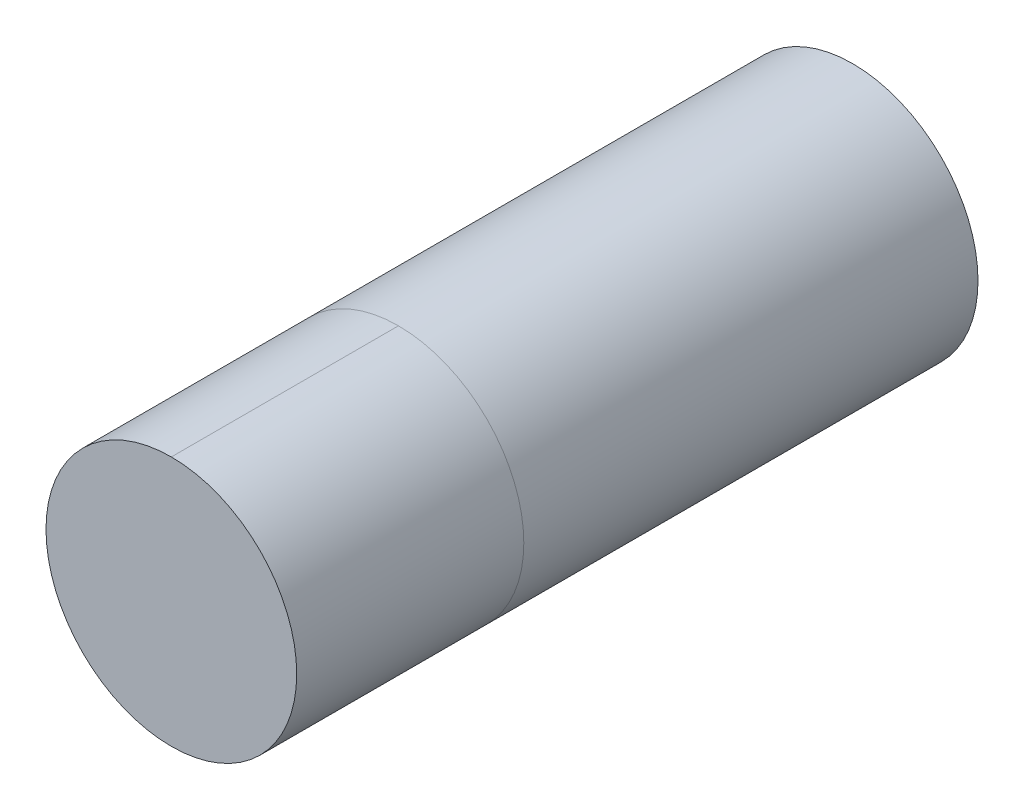
ISO-10303-21;
HEADER;
FILE_DESCRIPTION(('STEP AP214'),'2;1');
FILE_NAME('part.step','',(''),(''),'','','');
FILE_SCHEMA(('AUTOMOTIVE_DESIGN { 1 0 10303 214 1 1 1 1 }'));
ENDSEC;
DATA;
#1=APPLICATION_CONTEXT('core data for automotive mechanical design processes');
#2=APPLICATION_PROTOCOL_DEFINITION('international standard','automotive_design',2000,#1);
#3=PRODUCT_CONTEXT('',#1,'mechanical');
#4=PRODUCT('Part','Part','',(#3));
#5=PRODUCT_RELATED_PRODUCT_CATEGORY('part','',(#4));
#6=PRODUCT_DEFINITION_FORMATION('','',#4);
#7=PRODUCT_DEFINITION_CONTEXT('part definition',#1,'design');
#8=PRODUCT_DEFINITION('design','',#6,#7);
#9=PRODUCT_DEFINITION_SHAPE('','',#8);
#10=(LENGTH_UNIT() NAMED_UNIT(*) SI_UNIT(.MILLI.,.METRE.));
#11=(NAMED_UNIT(*) PLANE_ANGLE_UNIT() SI_UNIT($,.RADIAN.));
#12=(NAMED_UNIT(*) SI_UNIT($,.STERADIAN.) SOLID_ANGLE_UNIT());
#13=UNCERTAINTY_MEASURE_WITH_UNIT(LENGTH_MEASURE(1.E-05),#10,'distance_accuracy_value','');
#14=(GEOMETRIC_REPRESENTATION_CONTEXT(3) GLOBAL_UNCERTAINTY_ASSIGNED_CONTEXT((#13)) GLOBAL_UNIT_ASSIGNED_CONTEXT((#10,
#11,#12)) REPRESENTATION_CONTEXT('',''));
#15=CARTESIAN_POINT('',(0.,0.,0.));
#16=DIRECTION('',(0.,0.,1.));
#17=DIRECTION('',(1.,0.,0.));
#18=AXIS2_PLACEMENT_3D('',#15,#16,#17);
#19=CARTESIAN_POINT('',(0.,0.,9.525));
#20=DIRECTION('',(0.,0.,-1.));
#21=DIRECTION('',(-1.,0.,0.));
#22=AXIS2_PLACEMENT_3D('',#19,#20,#21);
#23=CYLINDRICAL_SURFACE('',#22,1.75259999999999);
#24=CARTESIAN_POINT('',(0.,0.,9.525));
#25=DIRECTION('',(0.,0.,1.));
#26=DIRECTION('',(1.,0.,0.));
#27=AXIS2_PLACEMENT_3D('',#24,#25,#26);
#28=CIRCLE('',#27,1.75259999999999);
#29=CARTESIAN_POINT('',(0.,1.75259999999999,9.525));
#30=VERTEX_POINT('',#29);
#31=CARTESIAN_POINT('',(0.,-1.75259999999999,9.525));
#32=VERTEX_POINT('',#31);
#33=EDGE_CURVE('E74',#30,#32,#28,.T.);
#34=ORIENTED_EDGE('',*,*,#33,.F.);
#35=DIRECTION('',(0.,0.,-1.));
#36=VECTOR('',#35,1.);
#37=CARTESIAN_POINT('',(0.,1.75259999999999,9.525));
#38=LINE('',#37,#36);
#39=CARTESIAN_POINT('',(0.,1.75259999999999,6.35));
#40=VERTEX_POINT('',#39);
#41=EDGE_CURVE('E12',#30,#40,#38,.T.);
#42=ORIENTED_EDGE('',*,*,#41,.T.);
#43=CARTESIAN_POINT('',(0.,0.,6.35));
#44=DIRECTION('',(0.,0.,1.));
#45=DIRECTION('',(1.,0.,0.));
#46=AXIS2_PLACEMENT_3D('',#43,#44,#45);
#47=CIRCLE('',#46,1.75259999999999);
#48=CARTESIAN_POINT('',(0.,-1.75259999999999,6.35));
#49=VERTEX_POINT('',#48);
#50=EDGE_CURVE('E81',#40,#49,#47,.T.);
#51=ORIENTED_EDGE('',*,*,#50,.T.);
#52=DIRECTION('',(0.,0.,1.));
#53=VECTOR('',#52,1.);
#54=CARTESIAN_POINT('',(0.,-1.75259999999999,9.525));
#55=LINE('',#54,#53);
#56=EDGE_CURVE('E57',#49,#32,#55,.T.);
#57=ORIENTED_EDGE('',*,*,#56,.T.);
#58=EDGE_LOOP('',(#34,#42,#51,#57));
#59=FACE_BOUND('',#58,.T.);
#60=ADVANCED_FACE('F48',(#59),#23,.T.);
#61=ORIENTED_EDGE('',*,*,#41,.F.);
#62=EDGE_CURVE('E77',#32,#30,#28,.T.);
#63=ORIENTED_EDGE('',*,*,#62,.F.);
#64=ORIENTED_EDGE('',*,*,#56,.F.);
#65=EDGE_CURVE('E78',#49,#40,#47,.T.);
#66=ORIENTED_EDGE('',*,*,#65,.T.);
#67=EDGE_LOOP('',(#61,#63,#64,#66));
#68=FACE_BOUND('',#67,.T.);
#69=ADVANCED_FACE('F50',(#68),#23,.T.);
#70=CARTESIAN_POINT('',(0.,0.,9.525));
#71=DIRECTION('',(0.,0.,1.));
#72=DIRECTION('',(1.,0.,0.));
#73=AXIS2_PLACEMENT_3D('',#70,#71,#72);
#74=PLANE('',#73);
#75=ORIENTED_EDGE('',*,*,#62,.T.);
#76=ORIENTED_EDGE('',*,*,#33,.T.);
#77=EDGE_LOOP('',(#75,#76));
#78=FACE_BOUND('',#77,.T.);
#79=ADVANCED_FACE('F76',(#78),#74,.T.);
#80=CARTESIAN_POINT('',(0.,0.,6.35));
#81=DIRECTION('',(0.,0.,1.));
#82=DIRECTION('',(1.,0.,0.));
#83=AXIS2_PLACEMENT_3D('',#80,#81,#82);
#84=PLANE('',#83);
#85=ORIENTED_EDGE('',*,*,#65,.F.);
#86=ORIENTED_EDGE('',*,*,#50,.F.);
#87=EDGE_LOOP('',(#85,#86));
#88=FACE_BOUND('',#87,.T.);
#89=ADVANCED_FACE('F86',(#88),#84,.F.);
#90=CLOSED_SHELL('',(#60,#69,#79,#89));
#91=MANIFOLD_SOLID_BREP('B2',#90);
#92=CARTESIAN_POINT('',(0.,0.,6.35));
#93=DIRECTION('',(0.,0.,-1.));
#94=DIRECTION('',(-1.,0.,0.));
#95=AXIS2_PLACEMENT_3D('',#92,#93,#94);
#96=CYLINDRICAL_SURFACE('',#95,1.75259999999999);
#97=CARTESIAN_POINT('',(0.,0.,6.35));
#98=DIRECTION('',(0.,0.,1.));
#99=DIRECTION('',(1.,0.,0.));
#100=AXIS2_PLACEMENT_3D('',#97,#98,#99);
#101=CIRCLE('',#100,1.75259999999999);
#102=CARTESIAN_POINT('',(1.75259999999999,0.,6.35));
#103=VERTEX_POINT('',#102);
#104=EDGE_CURVE('E47',#103,#103,#101,.T.);
#105=ORIENTED_EDGE('',*,*,#104,.F.);
#106=EDGE_LOOP('',(#105));
#107=FACE_BOUND('',#106,.T.);
#108=CARTESIAN_POINT('',(0.,0.,0.));
#109=DIRECTION('',(0.,0.,1.));
#110=DIRECTION('',(1.,0.,0.));
#111=AXIS2_PLACEMENT_3D('',#108,#109,#110);
#112=CIRCLE('',#111,1.75259999999999);
#113=CARTESIAN_POINT('',(1.75259999999999,0.,0.));
#114=VERTEX_POINT('',#113);
#115=EDGE_CURVE('E132',#114,#114,#112,.T.);
#116=ORIENTED_EDGE('',*,*,#115,.T.);
#117=EDGE_LOOP('',(#116));
#118=FACE_BOUND('',#117,.T.);
#119=ADVANCED_FACE('F129',(#107,#118),#96,.T.);
#120=CARTESIAN_POINT('',(0.,0.,6.35));
#121=DIRECTION('',(0.,0.,1.));
#122=DIRECTION('',(1.,0.,0.));
#123=AXIS2_PLACEMENT_3D('',#120,#121,#122);
#124=PLANE('',#123);
#125=ORIENTED_EDGE('',*,*,#104,.T.);
#126=EDGE_LOOP('',(#125));
#127=FACE_BOUND('',#126,.T.);
#128=ADVANCED_FACE('F144',(#127),#124,.T.);
#129=CARTESIAN_POINT('',(0.,0.,0.));
#130=DIRECTION('',(0.,0.,1.));
#131=DIRECTION('',(1.,0.,0.));
#132=AXIS2_PLACEMENT_3D('',#129,#130,#131);
#133=PLANE('',#132);
#134=ORIENTED_EDGE('',*,*,#115,.F.);
#135=EDGE_LOOP('',(#134));
#136=FACE_BOUND('',#135,.T.);
#137=ADVANCED_FACE('F142',(#136),#133,.F.);
#138=CLOSED_SHELL('',(#119,#128,#137));
#139=MANIFOLD_SOLID_BREP('B6',#138);
#140=ADVANCED_BREP_SHAPE_REPRESENTATION('',(#18,#91,#139),#14);
#141=SHAPE_DEFINITION_REPRESENTATION(#9,#140);
ENDSEC;
END-ISO-10303-21;
